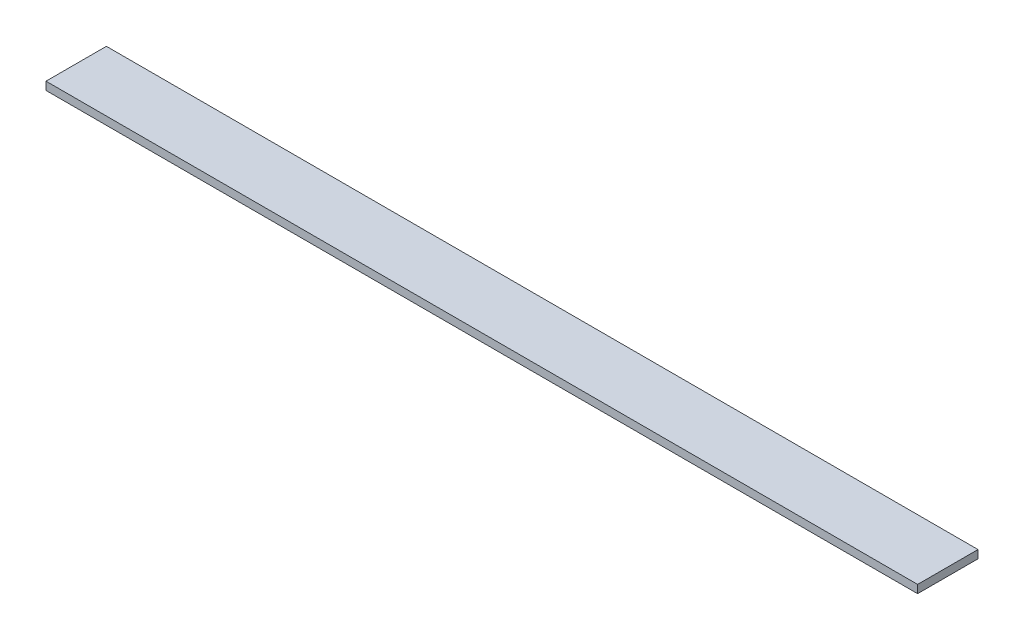
ISO-10303-21;
HEADER;
FILE_DESCRIPTION(('STEP AP214'),'2;1');
FILE_NAME('part.step','',(''),(''),'','','');
FILE_SCHEMA(('AUTOMOTIVE_DESIGN { 1 0 10303 214 1 1 1 1 }'));
ENDSEC;
DATA;
#1=APPLICATION_CONTEXT('core data for automotive mechanical design processes');
#2=APPLICATION_PROTOCOL_DEFINITION('international standard','automotive_design',2000,#1);
#3=PRODUCT_CONTEXT('',#1,'mechanical');
#4=PRODUCT('Part','Part','',(#3));
#5=PRODUCT_RELATED_PRODUCT_CATEGORY('part','',(#4));
#6=PRODUCT_DEFINITION_FORMATION('','',#4);
#7=PRODUCT_DEFINITION_CONTEXT('part definition',#1,'design');
#8=PRODUCT_DEFINITION('design','',#6,#7);
#9=PRODUCT_DEFINITION_SHAPE('','',#8);
#10=(LENGTH_UNIT() NAMED_UNIT(*) SI_UNIT(.MILLI.,.METRE.));
#11=(NAMED_UNIT(*) PLANE_ANGLE_UNIT() SI_UNIT($,.RADIAN.));
#12=(NAMED_UNIT(*) SI_UNIT($,.STERADIAN.) SOLID_ANGLE_UNIT());
#13=UNCERTAINTY_MEASURE_WITH_UNIT(LENGTH_MEASURE(1.E-05),#10,'distance_accuracy_value','');
#14=(GEOMETRIC_REPRESENTATION_CONTEXT(3) GLOBAL_UNCERTAINTY_ASSIGNED_CONTEXT((#13)) GLOBAL_UNIT_ASSIGNED_CONTEXT((#10,
#11,#12)) REPRESENTATION_CONTEXT('',''));
#15=CARTESIAN_POINT('',(0.,0.,0.));
#16=DIRECTION('',(0.,0.,1.));
#17=DIRECTION('',(1.,0.,0.));
#18=AXIS2_PLACEMENT_3D('',#15,#16,#17);
#19=CARTESIAN_POINT('',(433.,-2.,-15.));
#20=DIRECTION('',(0.,0.,1.));
#21=DIRECTION('',(1.,0.,0.));
#22=AXIS2_PLACEMENT_3D('',#19,#20,#21);
#23=PLANE('',#22);
#24=DIRECTION('',(0.,1.,0.));
#25=VECTOR('',#24,1.);
#26=CARTESIAN_POINT('',(0.,-2.,-15.));
#27=LINE('',#26,#25);
#28=CARTESIAN_POINT('',(0.,-2.,-15.));
#29=VERTEX_POINT('',#28);
#30=CARTESIAN_POINT('',(0.,2.,-15.));
#31=VERTEX_POINT('',#30);
#32=EDGE_CURVE('E98',#29,#31,#27,.T.);
#33=ORIENTED_EDGE('',*,*,#32,.T.);
#34=DIRECTION('',(-1.,0.,0.));
#35=VECTOR('',#34,1.);
#36=CARTESIAN_POINT('',(433.,2.,-15.));
#37=LINE('',#36,#35);
#38=CARTESIAN_POINT('',(433.,2.,-15.));
#39=VERTEX_POINT('',#38);
#40=EDGE_CURVE('E11',#39,#31,#37,.T.);
#41=ORIENTED_EDGE('',*,*,#40,.F.);
#42=DIRECTION('',(0.,1.,0.));
#43=VECTOR('',#42,1.);
#44=CARTESIAN_POINT('',(433.,-2.,-15.));
#45=LINE('',#44,#43);
#46=CARTESIAN_POINT('',(433.,-2.,-15.));
#47=VERTEX_POINT('',#46);
#48=EDGE_CURVE('E86',#47,#39,#45,.T.);
#49=ORIENTED_EDGE('',*,*,#48,.F.);
#50=DIRECTION('',(-1.,0.,0.));
#51=VECTOR('',#50,1.);
#52=CARTESIAN_POINT('',(433.,-2.,-15.));
#53=LINE('',#52,#51);
#54=EDGE_CURVE('E94',#47,#29,#53,.T.);
#55=ORIENTED_EDGE('',*,*,#54,.T.);
#56=EDGE_LOOP('',(#33,#41,#49,#55));
#57=FACE_BOUND('',#56,.T.);
#58=ADVANCED_FACE('F35',(#57),#23,.F.);
#59=CARTESIAN_POINT('',(433.,2.,15.));
#60=DIRECTION('',(0.,-1.,0.));
#61=DIRECTION('',(0.,0.,-1.));
#62=AXIS2_PLACEMENT_3D('',#59,#60,#61);
#63=PLANE('',#62);
#64=DIRECTION('',(0.,0.,1.));
#65=VECTOR('',#64,1.);
#66=CARTESIAN_POINT('',(0.,2.,15.));
#67=LINE('',#66,#65);
#68=CARTESIAN_POINT('',(0.,2.,15.));
#69=VERTEX_POINT('',#68);
#70=EDGE_CURVE('E90',#31,#69,#67,.T.);
#71=ORIENTED_EDGE('',*,*,#70,.T.);
#72=DIRECTION('',(-1.,0.,0.));
#73=VECTOR('',#72,1.);
#74=CARTESIAN_POINT('',(433.,2.,15.));
#75=LINE('',#74,#73);
#76=CARTESIAN_POINT('',(433.,2.,15.));
#77=VERTEX_POINT('',#76);
#78=EDGE_CURVE('E43',#77,#69,#75,.T.);
#79=ORIENTED_EDGE('',*,*,#78,.F.);
#80=DIRECTION('',(0.,0.,1.));
#81=VECTOR('',#80,1.);
#82=CARTESIAN_POINT('',(433.,2.,15.));
#83=LINE('',#82,#81);
#84=EDGE_CURVE('E81',#39,#77,#83,.T.);
#85=ORIENTED_EDGE('',*,*,#84,.F.);
#86=ORIENTED_EDGE('',*,*,#40,.T.);
#87=EDGE_LOOP('',(#71,#79,#85,#86));
#88=FACE_BOUND('',#87,.T.);
#89=ADVANCED_FACE('F89',(#88),#63,.F.);
#90=CARTESIAN_POINT('',(433.,-2.,15.));
#91=DIRECTION('',(0.,0.,-1.));
#92=DIRECTION('',(-1.,0.,0.));
#93=AXIS2_PLACEMENT_3D('',#90,#91,#92);
#94=PLANE('',#93);
#95=DIRECTION('',(0.,-1.,0.));
#96=VECTOR('',#95,1.);
#97=CARTESIAN_POINT('',(0.,-2.,15.));
#98=LINE('',#97,#96);
#99=CARTESIAN_POINT('',(0.,-2.,15.));
#100=VERTEX_POINT('',#99);
#101=EDGE_CURVE('E68',#69,#100,#98,.T.);
#102=ORIENTED_EDGE('',*,*,#101,.T.);
#103=DIRECTION('',(-1.,0.,0.));
#104=VECTOR('',#103,1.);
#105=CARTESIAN_POINT('',(433.,-2.,15.));
#106=LINE('',#105,#104);
#107=CARTESIAN_POINT('',(433.,-2.,15.));
#108=VERTEX_POINT('',#107);
#109=EDGE_CURVE('E91',#108,#100,#106,.T.);
#110=ORIENTED_EDGE('',*,*,#109,.F.);
#111=DIRECTION('',(0.,-1.,0.));
#112=VECTOR('',#111,1.);
#113=CARTESIAN_POINT('',(433.,-2.,15.));
#114=LINE('',#113,#112);
#115=EDGE_CURVE('E84',#77,#108,#114,.T.);
#116=ORIENTED_EDGE('',*,*,#115,.F.);
#117=ORIENTED_EDGE('',*,*,#78,.T.);
#118=EDGE_LOOP('',(#102,#110,#116,#117));
#119=FACE_BOUND('',#118,.T.);
#120=ADVANCED_FACE('F92',(#119),#94,.F.);
#121=CARTESIAN_POINT('',(433.,-2.,15.));
#122=DIRECTION('',(0.,1.,0.));
#123=DIRECTION('',(0.,0.,1.));
#124=AXIS2_PLACEMENT_3D('',#121,#122,#123);
#125=PLANE('',#124);
#126=DIRECTION('',(0.,0.,-1.));
#127=VECTOR('',#126,1.);
#128=CARTESIAN_POINT('',(0.,-2.,15.));
#129=LINE('',#128,#127);
#130=EDGE_CURVE('E74',#100,#29,#129,.T.);
#131=ORIENTED_EDGE('',*,*,#130,.T.);
#132=ORIENTED_EDGE('',*,*,#54,.F.);
#133=DIRECTION('',(0.,0.,-1.));
#134=VECTOR('',#133,1.);
#135=CARTESIAN_POINT('',(433.,-2.,15.));
#136=LINE('',#135,#134);
#137=EDGE_CURVE('E51',#108,#47,#136,.T.);
#138=ORIENTED_EDGE('',*,*,#137,.F.);
#139=ORIENTED_EDGE('',*,*,#109,.T.);
#140=EDGE_LOOP('',(#131,#132,#138,#139));
#141=FACE_BOUND('',#140,.T.);
#142=ADVANCED_FACE('F105',(#141),#125,.F.);
#143=CARTESIAN_POINT('',(433.,0.,0.));
#144=DIRECTION('',(-1.,0.,0.));
#145=DIRECTION('',(0.,0.,1.));
#146=AXIS2_PLACEMENT_3D('',#143,#144,#145);
#147=PLANE('',#146);
#148=ORIENTED_EDGE('',*,*,#48,.T.);
#149=ORIENTED_EDGE('',*,*,#84,.T.);
#150=ORIENTED_EDGE('',*,*,#115,.T.);
#151=ORIENTED_EDGE('',*,*,#137,.T.);
#152=EDGE_LOOP('',(#148,#149,#150,#151));
#153=FACE_BOUND('',#152,.T.);
#154=ADVANCED_FACE('F82',(#153),#147,.F.);
#155=CARTESIAN_POINT('',(0.,0.,0.));
#156=DIRECTION('',(-1.,0.,0.));
#157=DIRECTION('',(0.,0.,1.));
#158=AXIS2_PLACEMENT_3D('',#155,#156,#157);
#159=PLANE('',#158);
#160=ORIENTED_EDGE('',*,*,#32,.F.);
#161=ORIENTED_EDGE('',*,*,#130,.F.);
#162=ORIENTED_EDGE('',*,*,#101,.F.);
#163=ORIENTED_EDGE('',*,*,#70,.F.);
#164=EDGE_LOOP('',(#160,#161,#162,#163));
#165=FACE_BOUND('',#164,.T.);
#166=ADVANCED_FACE('F108',(#165),#159,.T.);
#167=CLOSED_SHELL('',(#58,#89,#120,#142,#154,#166));
#168=MANIFOLD_SOLID_BREP('B2',#167);
#169=ADVANCED_BREP_SHAPE_REPRESENTATION('',(#18,#168),#14);
#170=SHAPE_DEFINITION_REPRESENTATION(#9,#169);
ENDSEC;
END-ISO-10303-21;
